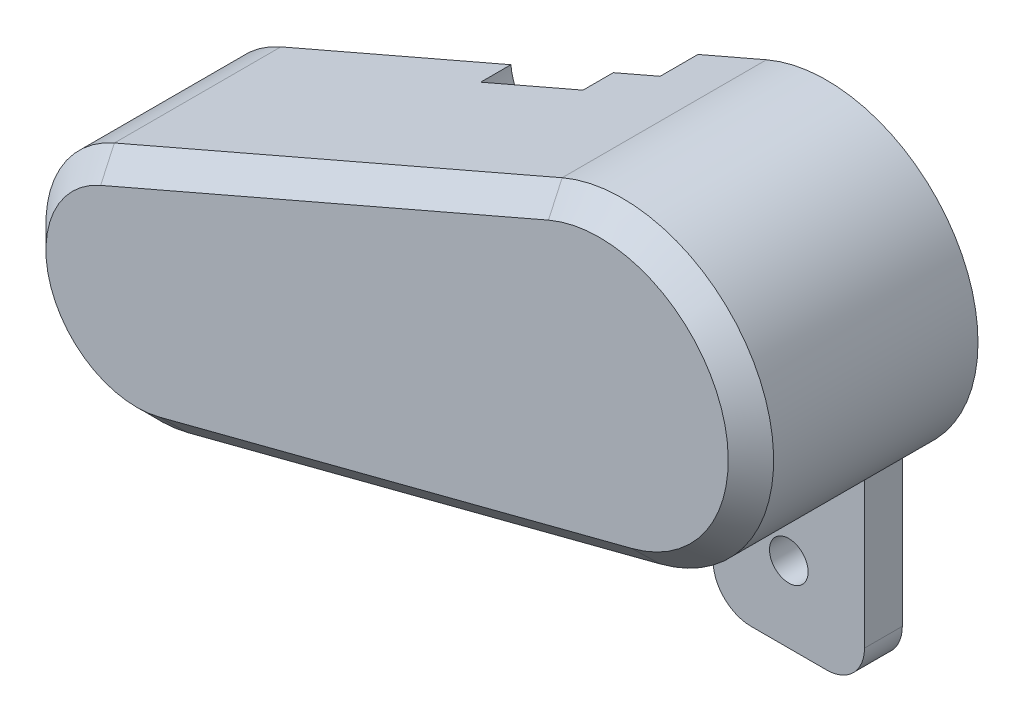
ISO-10303-21;
HEADER;
FILE_DESCRIPTION(('STEP AP214'),'2;1');
FILE_NAME('part.step','',(''),(''),'','','');
FILE_SCHEMA(('AUTOMOTIVE_DESIGN { 1 0 10303 214 1 1 1 1 }'));
ENDSEC;
DATA;
#1=APPLICATION_CONTEXT('core data for automotive mechanical design processes');
#2=APPLICATION_PROTOCOL_DEFINITION('international standard','automotive_design',2000,#1);
#3=PRODUCT_CONTEXT('',#1,'mechanical');
#4=PRODUCT('Part','Part','',(#3));
#5=PRODUCT_RELATED_PRODUCT_CATEGORY('part','',(#4));
#6=PRODUCT_DEFINITION_FORMATION('','',#4);
#7=PRODUCT_DEFINITION_CONTEXT('part definition',#1,'design');
#8=PRODUCT_DEFINITION('design','',#6,#7);
#9=PRODUCT_DEFINITION_SHAPE('','',#8);
#10=(LENGTH_UNIT() NAMED_UNIT(*) SI_UNIT(.MILLI.,.METRE.));
#11=(NAMED_UNIT(*) PLANE_ANGLE_UNIT() SI_UNIT($,.RADIAN.));
#12=(NAMED_UNIT(*) SI_UNIT($,.STERADIAN.) SOLID_ANGLE_UNIT());
#13=UNCERTAINTY_MEASURE_WITH_UNIT(LENGTH_MEASURE(1.E-05),#10,'distance_accuracy_value','');
#14=(GEOMETRIC_REPRESENTATION_CONTEXT(3) GLOBAL_UNCERTAINTY_ASSIGNED_CONTEXT((#13)) GLOBAL_UNIT_ASSIGNED_CONTEXT((#10,
#11,#12)) REPRESENTATION_CONTEXT('',''));
#15=CARTESIAN_POINT('',(0.,0.,0.));
#16=DIRECTION('',(0.,0.,1.));
#17=DIRECTION('',(1.,0.,0.));
#18=AXIS2_PLACEMENT_3D('',#15,#16,#17);
#19=CARTESIAN_POINT('',(-48.1077623284354,-39.7505775901013,29.9999935625005));
#20=DIRECTION('',(0.39718415521736,-0.91773893174708,0.));
#21=DIRECTION('',(0.91773893174708,0.39718415521736,0.));
#22=AXIS2_PLACEMENT_3D('',#19,#20,#21);
#23=PLANE('',#22);
#24=DIRECTION('',(0.,0.,-1.));
#25=VECTOR('',#24,1.);
#26=CARTESIAN_POINT('',(-17.7154879863189,-26.5972401951977,8.99999356250022));
#27=LINE('',#26,#25);
#28=CARTESIAN_POINT('',(-17.7154879863189,-26.5972401951977,4.99999356250022));
#29=VERTEX_POINT('',#28);
#30=CARTESIAN_POINT('',(-17.7154879863189,-26.5972401951977,8.99999356250022));
#31=VERTEX_POINT('',#30);
#32=EDGE_CURVE('E277',#29,#31,#27,.F.);
#33=ORIENTED_EDGE('',*,*,#32,.F.);
#34=DIRECTION('',(0.91773893174708,0.39718415521736,0.));
#35=VECTOR('',#34,1.);
#36=CARTESIAN_POINT('',(-48.1077623284354,-39.7505775901013,4.99999356250022));
#37=LINE('',#36,#35);
#38=CARTESIAN_POINT('',(-48.1077623284354,-39.7505775901013,4.99999356250022));
#39=VERTEX_POINT('',#38);
#40=EDGE_CURVE('E306',#39,#29,#37,.T.);
#41=ORIENTED_EDGE('',*,*,#40,.F.);
#42=DIRECTION('',(0.,0.,-1.));
#43=VECTOR('',#42,1.);
#44=CARTESIAN_POINT('',(-48.1077623284354,-39.7505775901013,29.9999935625005));
#45=LINE('',#44,#43);
#46=CARTESIAN_POINT('',(-48.1077623284354,-39.7505775901013,26.9999935625005));
#47=VERTEX_POINT('',#46);
#48=EDGE_CURVE('E337',#47,#39,#45,.T.);
#49=ORIENTED_EDGE('',*,*,#48,.F.);
#50=DIRECTION('',(0.91773893174708,0.39718415521736,0.));
#51=VECTOR('',#50,1.);
#52=CARTESIAN_POINT('',(11.0563104581527,-14.1452213650747,26.9999935625005));
#53=LINE('',#52,#51);
#54=CARTESIAN_POINT('',(11.0563104581527,-14.1452213650747,26.9999935625005));
#55=VERTEX_POINT('',#54);
#56=EDGE_CURVE('E386',#47,#55,#53,.T.);
#57=ORIENTED_EDGE('',*,*,#56,.T.);
#58=DIRECTION('',(0.,0.,-1.));
#59=VECTOR('',#58,1.);
#60=CARTESIAN_POINT('',(11.0563104581527,-14.1452213650747,29.9999935625005));
#61=LINE('',#60,#59);
#62=CARTESIAN_POINT('',(11.0563104581527,-14.1452213650747,0.));
#63=VERTEX_POINT('',#62);
#64=EDGE_CURVE('E341',#55,#63,#61,.T.);
#65=ORIENTED_EDGE('',*,*,#64,.T.);
#66=DIRECTION('',(-0.91773893174708,-0.39718415521736,0.));
#67=VECTOR('',#66,1.);
#68=CARTESIAN_POINT('',(-48.1077623284354,-39.7505775901013,0.));
#69=LINE('',#68,#67);
#70=CARTESIAN_POINT('',(2.,-18.0646617356166,0.));
#71=VERTEX_POINT('',#70);
#72=EDGE_CURVE('E327',#63,#71,#69,.T.);
#73=ORIENTED_EDGE('',*,*,#72,.T.);
#74=DIRECTION('',(0.,0.,-1.));
#75=VECTOR('',#74,1.);
#76=CARTESIAN_POINT('',(2.,-18.0646617356166,29.9999935625005));
#77=LINE('',#76,#75);
#78=CARTESIAN_POINT('',(2.,-18.0646617356166,4.99999356250022));
#79=VERTEX_POINT('',#78);
#80=EDGE_CURVE('E291',#79,#71,#77,.T.);
#81=ORIENTED_EDGE('',*,*,#80,.F.);
#82=CARTESIAN_POINT('',(-4.18622111210832,-20.7419688884504,4.99999356250022));
#83=VERTEX_POINT('',#82);
#84=EDGE_CURVE('E305',#83,#79,#37,.T.);
#85=ORIENTED_EDGE('',*,*,#84,.F.);
#86=DIRECTION('',(0.,0.,-1.));
#87=VECTOR('',#86,1.);
#88=CARTESIAN_POINT('',(-4.18622111210832,-20.7419688884504,8.99999356250022));
#89=LINE('',#88,#87);
#90=CARTESIAN_POINT('',(-4.18622111210832,-20.7419688884504,8.99999356250022));
#91=VERTEX_POINT('',#90);
#92=EDGE_CURVE('E275',#91,#83,#89,.T.);
#93=ORIENTED_EDGE('',*,*,#92,.F.);
#94=DIRECTION('',(-0.91773893174708,-0.39718415521736,0.));
#95=VECTOR('',#94,1.);
#96=CARTESIAN_POINT('',(-48.1077623284354,-39.7505775901013,8.99999356250022));
#97=LINE('',#96,#95);
#98=EDGE_CURVE('E279',#91,#31,#97,.T.);
#99=ORIENTED_EDGE('',*,*,#98,.T.);
#100=EDGE_LOOP('',(#33,#41,#49,#57,#65,#73,#81,#85,#93,#99));
#101=FACE_BOUND('',#100,.T.);
#102=ADVANCED_FACE('F32',(#101),#23,.F.);
#103=CARTESIAN_POINT('',(-46.9162098627834,-42.5037943853426,-111.277525292104));
#104=DIRECTION('',(0.39718415521736,-0.91773893174708,0.));
#105=DIRECTION('',(0.91773893174708,0.39718415521736,0.));
#106=AXIS2_PLACEMENT_3D('',#103,#104,#105);
#107=PLANE('',#106);
#108=DIRECTION('',(0.91773893174708,0.39718415521736,0.));
#109=VECTOR('',#108,1.);
#110=CARTESIAN_POINT('',(-46.9162098627834,-42.5037943853426,4.99999356250022));
#111=LINE('',#110,#109);
#112=CARTESIAN_POINT('',(-46.9162098627834,-42.5037943853426,4.99999356250022));
#113=VERTEX_POINT('',#112);
#114=CARTESIAN_POINT('',(-16.8500010206727,-29.4915734296411,4.99999356250022));
#115=VERTEX_POINT('',#114);
#116=EDGE_CURVE('E302',#113,#115,#111,.T.);
#117=ORIENTED_EDGE('',*,*,#116,.T.);
#118=DIRECTION('',(0.,0.,-1.));
#119=VECTOR('',#118,1.);
#120=CARTESIAN_POINT('',(-16.8500010206727,-29.4915734296411,8.99999356250022));
#121=LINE('',#120,#119);
#122=CARTESIAN_POINT('',(-16.8500010206727,-29.4915734296411,8.99999356250022));
#123=VERTEX_POINT('',#122);
#124=EDGE_CURVE('E272',#115,#123,#121,.F.);
#125=ORIENTED_EDGE('',*,*,#124,.T.);
#126=DIRECTION('',(-0.91773893174708,-0.39718415521736,0.));
#127=VECTOR('',#126,1.);
#128=CARTESIAN_POINT('',(-46.9162098627834,-42.5037943853426,8.99999356250022));
#129=LINE('',#128,#127);
#130=CARTESIAN_POINT('',(-2.66860314645035,-23.3540692444895,8.99999356250022));
#131=VERTEX_POINT('',#130);
#132=EDGE_CURVE('E11',#131,#123,#129,.T.);
#133=ORIENTED_EDGE('',*,*,#132,.F.);
#134=DIRECTION('',(0.,0.,-1.));
#135=VECTOR('',#134,1.);
#136=CARTESIAN_POINT('',(-2.66860314645035,-23.3540692444895,8.99999356250022));
#137=LINE('',#136,#135);
#138=CARTESIAN_POINT('',(-2.66860314645035,-23.3540692444895,4.99999356250022));
#139=VERTEX_POINT('',#138);
#140=EDGE_CURVE('E266',#131,#139,#137,.T.);
#141=ORIENTED_EDGE('',*,*,#140,.T.);
#142=CARTESIAN_POINT('',(2.,-21.3335652289978,4.99999356250022));
#143=VERTEX_POINT('',#142);
#144=EDGE_CURVE('E301',#139,#143,#111,.T.);
#145=ORIENTED_EDGE('',*,*,#144,.T.);
#146=DIRECTION('',(0.,0.,-1.));
#147=VECTOR('',#146,1.);
#148=CARTESIAN_POINT('',(2.,-21.3335652289978,-111.277525292104));
#149=LINE('',#148,#147);
#150=CARTESIAN_POINT('',(2.,-21.3335652289978,0.));
#151=VERTEX_POINT('',#150);
#152=EDGE_CURVE('E288',#143,#151,#149,.T.);
#153=ORIENTED_EDGE('',*,*,#152,.T.);
#154=DIRECTION('',(-0.91773893174708,-0.39718415521736,0.));
#155=VECTOR('',#154,1.);
#156=CARTESIAN_POINT('',(-46.9162098627834,-42.5037943853426,0.));
#157=LINE('',#156,#155);
#158=CARTESIAN_POINT('',(12.2478629238048,-16.8984381603159,0.));
#159=VERTEX_POINT('',#158);
#160=EDGE_CURVE('E334',#159,#151,#157,.T.);
#161=ORIENTED_EDGE('',*,*,#160,.F.);
#162=DIRECTION('',(0.,0.,1.));
#163=VECTOR('',#162,1.);
#164=CARTESIAN_POINT('',(12.2478629238048,-16.8984381603159,-111.277525292104));
#165=LINE('',#164,#163);
#166=CARTESIAN_POINT('',(12.2478629238048,-16.8984381603159,23.9999935625005));
#167=VERTEX_POINT('',#166);
#168=EDGE_CURVE('E320',#159,#167,#165,.T.);
#169=ORIENTED_EDGE('',*,*,#168,.T.);
#170=DIRECTION('',(-0.91773893174708,-0.39718415521736,0.));
#171=VECTOR('',#170,1.);
#172=CARTESIAN_POINT('',(-46.9162098627834,-42.5037943853426,23.9999935625005));
#173=LINE('',#172,#171);
#174=CARTESIAN_POINT('',(-46.9162098627834,-42.5037943853426,23.9999935625005));
#175=VERTEX_POINT('',#174);
#176=EDGE_CURVE('E367',#167,#175,#173,.T.);
#177=ORIENTED_EDGE('',*,*,#176,.T.);
#178=DIRECTION('',(0.,0.,1.));
#179=VECTOR('',#178,1.);
#180=CARTESIAN_POINT('',(-46.9162098627834,-42.5037943853426,-111.277525292104));
#181=LINE('',#180,#179);
#182=EDGE_CURVE('E318',#113,#175,#181,.T.);
#183=ORIENTED_EDGE('',*,*,#182,.F.);
#184=EDGE_LOOP('',(#117,#125,#133,#141,#145,#153,#161,#169,#177,#183));
#185=FACE_BOUND('',#184,.T.);
#186=ADVANCED_FACE('F420',(#185),#107,.T.);
#187=CARTESIAN_POINT('',(0.,0.,4.99999356250022));
#188=DIRECTION('',(0.,0.,-1.));
#189=DIRECTION('',(-1.,0.,0.));
#190=AXIS2_PLACEMENT_3D('',#187,#188,#189);
#191=PLANE('',#190);
#192=ORIENTED_EDGE('',*,*,#40,.T.);
#193=CARTESIAN_POINT('',(-9.99999999999934,-25.86666156633,4.99999356250022));
#194=DIRECTION('',(0.,0.,-1.));
#195=DIRECTION('',(-1.,0.,0.));
#196=AXIS2_PLACEMENT_3D('',#193,#194,#195);
#197=CIRCLE('',#196,7.75);
#198=EDGE_CURVE('E40',#29,#115,#197,.F.);
#199=ORIENTED_EDGE('',*,*,#198,.T.);
#200=ORIENTED_EDGE('',*,*,#116,.F.);
#201=CARTESIAN_POINT('',(-42.150000000175,-53.5166615663075,4.99999356250022));
#202=DIRECTION('',(0.,0.,-1.));
#203=DIRECTION('',(-1.,0.,0.));
#204=AXIS2_PLACEMENT_3D('',#201,#202,#203);
#205=CIRCLE('',#204,12.);
#206=CARTESIAN_POINT('',(-39.1388633279181,-65.1327304340867,4.99999356250022));
#207=VERTEX_POINT('',#206);
#208=EDGE_CURVE('E298',#207,#113,#205,.T.);
#209=ORIENTED_EDGE('',*,*,#208,.F.);
#210=DIRECTION('',(-0.968005738981601,-0.250928056021413,0.));
#211=VECTOR('',#210,1.);
#212=CARTESIAN_POINT('',(23.2657705148639,-48.9560975627035,4.99999356250022));
#213=LINE('',#212,#211);
#214=CARTESIAN_POINT('',(-17.9999999999994,-59.6530791595422,4.99999356250022));
#215=VERTEX_POINT('',#214);
#216=EDGE_CURVE('E410',#215,#207,#213,.T.);
#217=ORIENTED_EDGE('',*,*,#216,.F.);
#218=DIRECTION('',(0.,-1.,0.));
#219=VECTOR('',#218,1.);
#220=CARTESIAN_POINT('',(-17.9999999999994,-39.36666156633,4.99999356250022));
#221=LINE('',#220,#219);
#222=CARTESIAN_POINT('',(-17.9999999999994,-62.7522343392999,4.99999356250022));
#223=VERTEX_POINT('',#222);
#224=EDGE_CURVE('E285',#215,#223,#221,.T.);
#225=ORIENTED_EDGE('',*,*,#224,.T.);
#226=DIRECTION('',(-0.968005738981601,-0.250928056021413,0.));
#227=VECTOR('',#226,1.);
#228=CARTESIAN_POINT('',(-38.3860791598538,-68.0367476510315,4.99999356250022));
#229=LINE('',#228,#227);
#230=CARTESIAN_POINT('',(-38.3860791598538,-68.0367476510315,4.99999356250022));
#231=VERTEX_POINT('',#230);
#232=EDGE_CURVE('E311',#223,#231,#229,.T.);
#233=ORIENTED_EDGE('',*,*,#232,.T.);
#234=CARTESIAN_POINT('',(-42.150000000175,-53.5166615663075,4.99999356250022));
#235=DIRECTION('',(0.,0.,-1.));
#236=DIRECTION('',(-1.,0.,0.));
#237=AXIS2_PLACEMENT_3D('',#234,#235,#236);
#238=CIRCLE('',#237,15.);
#239=EDGE_CURVE('E309',#231,#39,#238,.T.);
#240=ORIENTED_EDGE('',*,*,#239,.T.);
#241=EDGE_LOOP('',(#192,#199,#200,#209,#217,#225,#233,#240));
#242=FACE_BOUND('',#241,.T.);
#243=ADVANCED_FACE('F414',(#242),#191,.T.);
#244=ORIENTED_EDGE('',*,*,#144,.F.);
#245=CARTESIAN_POINT('',(-9.99999999999934,-25.86666156633,4.99999356250022));
#246=DIRECTION('',(0.,0.,1.));
#247=DIRECTION('',(1.,0.,0.));
#248=AXIS2_PLACEMENT_3D('',#245,#246,#247);
#249=CIRCLE('',#248,7.75);
#250=EDGE_CURVE('E256',#139,#83,#249,.T.);
#251=ORIENTED_EDGE('',*,*,#250,.T.);
#252=ORIENTED_EDGE('',*,*,#84,.T.);
#253=DIRECTION('',(0.,-1.,0.));
#254=VECTOR('',#253,1.);
#255=CARTESIAN_POINT('',(2.,-10.5000000000155,4.99999356250022));
#256=LINE('',#255,#254);
#257=EDGE_CURVE('E282',#79,#143,#256,.T.);
#258=ORIENTED_EDGE('',*,*,#257,.T.);
#259=EDGE_LOOP('',(#244,#251,#252,#258));
#260=FACE_BOUND('',#259,.T.);
#261=ADVANCED_FACE('F489',(#260),#191,.T.);
#262=CARTESIAN_POINT('',(-42.150000000175,-53.5166615663075,29.9999935625005));
#263=DIRECTION('',(0.,0.,-1.));
#264=DIRECTION('',(-1.,0.,0.));
#265=AXIS2_PLACEMENT_3D('',#262,#263,#264);
#266=CYLINDRICAL_SURFACE('',#265,15.);
#267=ORIENTED_EDGE('',*,*,#239,.F.);
#268=DIRECTION('',(0.,0.,-1.));
#269=VECTOR('',#268,1.);
#270=CARTESIAN_POINT('',(-38.3860791598538,-68.0367476510315,29.9999935625005));
#271=LINE('',#270,#269);
#272=CARTESIAN_POINT('',(-38.3860791598538,-68.0367476510315,26.9999935625005));
#273=VERTEX_POINT('',#272);
#274=EDGE_CURVE('E347',#273,#231,#271,.T.);
#275=ORIENTED_EDGE('',*,*,#274,.F.);
#276=CARTESIAN_POINT('',(-42.150000000175,-53.5166615663075,26.9999935625005));
#277=DIRECTION('',(0.,0.,1.));
#278=DIRECTION('',(1.,0.,0.));
#279=AXIS2_PLACEMENT_3D('',#276,#277,#278);
#280=CIRCLE('',#279,15.);
#281=EDGE_CURVE('E384',#273,#47,#280,.F.);
#282=ORIENTED_EDGE('',*,*,#281,.T.);
#283=ORIENTED_EDGE('',*,*,#48,.T.);
#284=EDGE_LOOP('',(#267,#275,#282,#283));
#285=FACE_BOUND('',#284,.T.);
#286=ADVANCED_FACE('F486',(#285),#266,.T.);
#287=CARTESIAN_POINT('',(-38.3860791598538,-68.0367476510315,29.9999935625005));
#288=DIRECTION('',(-0.250928056021413,0.9680057389816,0.));
#289=DIRECTION('',(-0.968005738981601,-0.250928056021413,0.));
#290=AXIS2_PLACEMENT_3D('',#287,#288,#289);
#291=PLANE('',#290);
#292=DIRECTION('',(0.968005738981601,0.250928056021413,0.));
#293=VECTOR('',#292,1.);
#294=CARTESIAN_POINT('',(24.0185546829281,-51.8601147796483,0.));
#295=LINE('',#294,#293);
#296=CARTESIAN_POINT('',(-17.9999999999994,-62.7522343392999,0.));
#297=VERTEX_POINT('',#296);
#298=CARTESIAN_POINT('',(8.99999356249987,-55.7532511469519,0.));
#299=VERTEX_POINT('',#298);
#300=EDGE_CURVE('E52',#297,#299,#295,.T.);
#301=ORIENTED_EDGE('',*,*,#300,.T.);
#302=DIRECTION('',(0.,0.,-1.));
#303=VECTOR('',#302,1.);
#304=CARTESIAN_POINT('',(8.99999356249987,-55.7532511469519,5.));
#305=LINE('',#304,#303);
#306=CARTESIAN_POINT('',(8.99999356249987,-55.7532511469519,5.));
#307=VERTEX_POINT('',#306);
#308=EDGE_CURVE('E47',#307,#299,#305,.T.);
#309=ORIENTED_EDGE('',*,*,#308,.F.);
#310=DIRECTION('',(0.9680057389816,0.250928056021413,0.));
#311=VECTOR('',#310,1.);
#312=CARTESIAN_POINT('',(8.99999356249987,-55.7532511469519,5.));
#313=LINE('',#312,#311);
#314=CARTESIAN_POINT('',(24.0185546829281,-51.8601147796483,5.));
#315=VERTEX_POINT('',#314);
#316=EDGE_CURVE('E231',#307,#315,#313,.T.);
#317=ORIENTED_EDGE('',*,*,#316,.T.);
#318=DIRECTION('',(0.,0.,-1.));
#319=VECTOR('',#318,1.);
#320=CARTESIAN_POINT('',(24.0185546829281,-51.8601147796483,29.9999935625005));
#321=LINE('',#320,#319);
#322=CARTESIAN_POINT('',(24.0185546829281,-51.8601147796483,26.9999935625005));
#323=VERTEX_POINT('',#322);
#324=EDGE_CURVE('E344',#323,#315,#321,.T.);
#325=ORIENTED_EDGE('',*,*,#324,.F.);
#326=DIRECTION('',(-0.968005738981601,-0.250928056021413,0.));
#327=VECTOR('',#326,1.);
#328=CARTESIAN_POINT('',(-38.3860791598538,-68.0367476510315,26.9999935625005));
#329=LINE('',#328,#327);
#330=EDGE_CURVE('E379',#323,#273,#329,.T.);
#331=ORIENTED_EDGE('',*,*,#330,.T.);
#332=ORIENTED_EDGE('',*,*,#274,.T.);
#333=ORIENTED_EDGE('',*,*,#232,.F.);
#334=DIRECTION('',(0.,0.,1.));
#335=VECTOR('',#334,1.);
#336=CARTESIAN_POINT('',(-17.9999999999994,-62.7522343392999,29.9999935625005));
#337=LINE('',#336,#335);
#338=EDGE_CURVE('E296',#297,#223,#337,.T.);
#339=ORIENTED_EDGE('',*,*,#338,.F.);
#340=EDGE_LOOP('',(#301,#309,#317,#325,#331,#332,#333,#339));
#341=FACE_BOUND('',#340,.T.);
#342=ADVANCED_FACE('F483',(#341),#291,.F.);
#343=CARTESIAN_POINT('',(-42.150000000175,-53.5166615663075,-111.277525292104));
#344=DIRECTION('',(0.,0.,1.));
#345=DIRECTION('',(1.,0.,0.));
#346=AXIS2_PLACEMENT_3D('',#343,#344,#345);
#347=CYLINDRICAL_SURFACE('',#346,12.);
#348=DIRECTION('',(0.,0.,1.));
#349=VECTOR('',#348,1.);
#350=CARTESIAN_POINT('',(-39.1388633279181,-65.1327304340867,-111.277525292104));
#351=LINE('',#350,#349);
#352=CARTESIAN_POINT('',(-39.1388633279181,-65.1327304340867,23.9999935625005));
#353=VERTEX_POINT('',#352);
#354=EDGE_CURVE('E317',#207,#353,#351,.T.);
#355=ORIENTED_EDGE('',*,*,#354,.F.);
#356=ORIENTED_EDGE('',*,*,#208,.T.);
#357=ORIENTED_EDGE('',*,*,#182,.T.);
#358=CARTESIAN_POINT('',(-42.150000000175,-53.5166615663075,23.9999935625005));
#359=DIRECTION('',(0.,0.,1.));
#360=DIRECTION('',(1.,0.,0.));
#361=AXIS2_PLACEMENT_3D('',#358,#359,#360);
#362=CIRCLE('',#361,12.);
#363=EDGE_CURVE('E362',#175,#353,#362,.T.);
#364=ORIENTED_EDGE('',*,*,#363,.T.);
#365=EDGE_LOOP('',(#355,#356,#357,#364));
#366=FACE_BOUND('',#365,.T.);
#367=ADVANCED_FACE('F426',(#366),#347,.F.);
#368=CARTESIAN_POINT('',(23.2657705148639,-48.9560975627035,-111.277525292104));
#369=DIRECTION('',(-0.250928056021413,0.968005738981601,0.));
#370=DIRECTION('',(-0.968005738981601,-0.250928056021413,0.));
#371=AXIS2_PLACEMENT_3D('',#368,#369,#370);
#372=PLANE('',#371);
#373=DIRECTION('',(0.,0.,1.));
#374=VECTOR('',#373,1.);
#375=CARTESIAN_POINT('',(-17.9999999999994,-59.6530791595422,-111.277525292104));
#376=LINE('',#375,#374);
#377=CARTESIAN_POINT('',(-17.9999999999994,-59.6530791595422,0.));
#378=VERTEX_POINT('',#377);
#379=EDGE_CURVE('E293',#378,#215,#376,.T.);
#380=ORIENTED_EDGE('',*,*,#379,.T.);
#381=ORIENTED_EDGE('',*,*,#216,.T.);
#382=ORIENTED_EDGE('',*,*,#354,.T.);
#383=DIRECTION('',(0.968005738981601,0.250928056021413,0.));
#384=VECTOR('',#383,1.);
#385=CARTESIAN_POINT('',(23.2657705148639,-48.9560975627035,23.9999935625005));
#386=LINE('',#385,#384);
#387=CARTESIAN_POINT('',(23.2657705148639,-48.9560975627035,23.9999935625005));
#388=VERTEX_POINT('',#387);
#389=EDGE_CURVE('E359',#353,#388,#386,.T.);
#390=ORIENTED_EDGE('',*,*,#389,.T.);
#391=DIRECTION('',(0.,0.,1.));
#392=VECTOR('',#391,1.);
#393=CARTESIAN_POINT('',(23.2657705148639,-48.9560975627035,-111.277525292104));
#394=LINE('',#393,#392);
#395=CARTESIAN_POINT('',(23.2657705148639,-48.9560975627035,0.));
#396=VERTEX_POINT('',#395);
#397=EDGE_CURVE('E323',#396,#388,#394,.T.);
#398=ORIENTED_EDGE('',*,*,#397,.F.);
#399=DIRECTION('',(0.968005738981601,0.250928056021413,0.));
#400=VECTOR('',#399,1.);
#401=CARTESIAN_POINT('',(23.2657705148639,-48.9560975627035,0.));
#402=LINE('',#401,#400);
#403=EDGE_CURVE('E314',#378,#396,#402,.T.);
#404=ORIENTED_EDGE('',*,*,#403,.F.);
#405=EDGE_LOOP('',(#380,#381,#382,#390,#398,#404));
#406=FACE_BOUND('',#405,.T.);
#407=ADVANCED_FACE('F431',(#406),#372,.T.);
#408=CARTESIAN_POINT('',(0.,0.,0.));
#409=DIRECTION('',(0.,0.,1.));
#410=DIRECTION('',(1.,0.,0.));
#411=AXIS2_PLACEMENT_3D('',#408,#409,#410);
#412=PLANE('',#411);
#413=DIRECTION('',(0.,-1.,0.));
#414=VECTOR('',#413,1.);
#415=CARTESIAN_POINT('',(-17.9999999999994,0.,0.));
#416=LINE('',#415,#414);
#417=EDGE_CURVE('E408',#378,#297,#416,.T.);
#418=ORIENTED_EDGE('',*,*,#417,.F.);
#419=ORIENTED_EDGE('',*,*,#403,.T.);
#420=CARTESIAN_POINT('',(18.9999935624999,-32.5000000000163,0.));
#421=DIRECTION('',(0.,0.,1.));
#422=DIRECTION('',(1.,0.,0.));
#423=AXIS2_PLACEMENT_3D('',#420,#421,#422);
#424=CIRCLE('',#423,17.);
#425=EDGE_CURVE('E316',#396,#159,#424,.T.);
#426=ORIENTED_EDGE('',*,*,#425,.T.);
#427=ORIENTED_EDGE('',*,*,#160,.T.);
#428=DIRECTION('',(0.,-1.,0.));
#429=VECTOR('',#428,1.);
#430=CARTESIAN_POINT('',(2.,0.,0.));
#431=LINE('',#430,#429);
#432=EDGE_CURVE('E388',#71,#151,#431,.T.);
#433=ORIENTED_EDGE('',*,*,#432,.F.);
#434=ORIENTED_EDGE('',*,*,#72,.F.);
#435=CARTESIAN_POINT('',(18.9999935624999,-32.5000000000163,0.));
#436=DIRECTION('',(0.,0.,1.));
#437=DIRECTION('',(1.,0.,0.));
#438=AXIS2_PLACEMENT_3D('',#435,#436,#437);
#439=CIRCLE('',#438,20.);
#440=CARTESIAN_POINT('',(28.9999935624999,-49.8205080757051,0.));
#441=VERTEX_POINT('',#440);
#442=EDGE_CURVE('E330',#441,#63,#439,.T.);
#443=ORIENTED_EDGE('',*,*,#442,.F.);
#444=DIRECTION('',(0.,-1.,0.));
#445=VECTOR('',#444,1.);
#446=CARTESIAN_POINT('',(28.9999935624999,-70.0000000000163,0.));
#447=LINE('',#446,#445);
#448=CARTESIAN_POINT('',(28.9999935624999,-70.0000000000163,0.));
#449=VERTEX_POINT('',#448);
#450=EDGE_CURVE('E242',#441,#449,#447,.T.);
#451=ORIENTED_EDGE('',*,*,#450,.T.);
#452=CARTESIAN_POINT('',(23.9999935624999,-70.0000000000163,0.));
#453=DIRECTION('',(0.,0.,-1.));
#454=DIRECTION('',(-1.,0.,0.));
#455=AXIS2_PLACEMENT_3D('',#452,#453,#454);
#456=CIRCLE('',#455,5.);
#457=CARTESIAN_POINT('',(23.9999935624999,-75.0000000000163,0.));
#458=VERTEX_POINT('',#457);
#459=EDGE_CURVE('E208',#449,#458,#456,.T.);
#460=ORIENTED_EDGE('',*,*,#459,.T.);
#461=DIRECTION('',(-1.,0.,0.));
#462=VECTOR('',#461,1.);
#463=CARTESIAN_POINT('',(13.9999935624999,-75.0000000000163,0.));
#464=LINE('',#463,#462);
#465=CARTESIAN_POINT('',(13.9999935624999,-75.0000000000163,0.));
#466=VERTEX_POINT('',#465);
#467=EDGE_CURVE('E246',#458,#466,#464,.T.);
#468=ORIENTED_EDGE('',*,*,#467,.T.);
#469=CARTESIAN_POINT('',(13.9999935624999,-70.0000000000163,0.));
#470=DIRECTION('',(0.,0.,-1.));
#471=DIRECTION('',(-1.,0.,0.));
#472=AXIS2_PLACEMENT_3D('',#469,#470,#471);
#473=CIRCLE('',#472,5.);
#474=CARTESIAN_POINT('',(8.99999356249987,-70.0000000000163,0.));
#475=VERTEX_POINT('',#474);
#476=EDGE_CURVE('E249',#466,#475,#473,.T.);
#477=ORIENTED_EDGE('',*,*,#476,.T.);
#478=DIRECTION('',(0.,1.,0.));
#479=VECTOR('',#478,1.);
#480=CARTESIAN_POINT('',(8.99999356249987,-55.7532511469519,0.));
#481=LINE('',#480,#479);
#482=EDGE_CURVE('E252',#475,#299,#481,.T.);
#483=ORIENTED_EDGE('',*,*,#482,.T.);
#484=ORIENTED_EDGE('',*,*,#300,.F.);
#485=EDGE_LOOP('',(#418,#419,#426,#427,#433,#434,#443,#451,#460,#468,#477,#483,#484));
#486=FACE_BOUND('',#485,.T.);
#487=CARTESIAN_POINT('',(18.9999935624999,-65.0000000000163,0.));
#488=DIRECTION('',(0.,0.,-1.));
#489=DIRECTION('',(-1.,0.,0.));
#490=AXIS2_PLACEMENT_3D('',#487,#488,#489);
#491=CIRCLE('',#490,2.55);
#492=CARTESIAN_POINT('',(16.4499935624999,-65.0000000000163,0.));
#493=VERTEX_POINT('',#492);
#494=EDGE_CURVE('E448',#493,#493,#491,.T.);
#495=ORIENTED_EDGE('',*,*,#494,.F.);
#496=EDGE_LOOP('',(#495));
#497=FACE_BOUND('',#496,.T.);
#498=ADVANCED_FACE('F438',(#486,#497),#412,.F.);
#499=CARTESIAN_POINT('',(18.9999935624999,-32.5000000000163,29.9999935625005));
#500=DIRECTION('',(0.,0.,-1.));
#501=DIRECTION('',(-1.,0.,0.));
#502=AXIS2_PLACEMENT_3D('',#499,#500,#501);
#503=CYLINDRICAL_SURFACE('',#502,20.);
#504=CARTESIAN_POINT('',(18.9999935624999,-32.5000000000163,5.));
#505=DIRECTION('',(0.,0.,1.));
#506=DIRECTION('',(-1.,0.,0.));
#507=AXIS2_PLACEMENT_3D('',#504,#505,#506);
#508=CIRCLE('',#507,20.);
#509=CARTESIAN_POINT('',(28.9999935624999,-49.8205080757051,5.));
#510=VERTEX_POINT('',#509);
#511=EDGE_CURVE('E229',#315,#510,#508,.T.);
#512=ORIENTED_EDGE('',*,*,#511,.T.);
#513=DIRECTION('',(0.,0.,-1.));
#514=VECTOR('',#513,1.);
#515=CARTESIAN_POINT('',(28.9999935624999,-49.8205080757051,5.));
#516=LINE('',#515,#514);
#517=EDGE_CURVE('E214',#510,#441,#516,.T.);
#518=ORIENTED_EDGE('',*,*,#517,.T.);
#519=ORIENTED_EDGE('',*,*,#442,.T.);
#520=ORIENTED_EDGE('',*,*,#64,.F.);
#521=CARTESIAN_POINT('',(18.9999935624999,-32.5000000000163,26.9999935625005));
#522=DIRECTION('',(0.,0.,1.));
#523=DIRECTION('',(1.,0.,0.));
#524=AXIS2_PLACEMENT_3D('',#521,#522,#523);
#525=CIRCLE('',#524,20.);
#526=EDGE_CURVE('E382',#55,#323,#525,.F.);
#527=ORIENTED_EDGE('',*,*,#526,.T.);
#528=ORIENTED_EDGE('',*,*,#324,.T.);
#529=EDGE_LOOP('',(#512,#518,#519,#520,#527,#528));
#530=FACE_BOUND('',#529,.T.);
#531=ADVANCED_FACE('F461',(#530),#503,.T.);
#532=CARTESIAN_POINT('',(-42.150000000175,-53.5166615663075,29.9999935625005));
#533=DIRECTION('',(0.,0.,1.));
#534=DIRECTION('',(1.,0.,0.));
#535=AXIS2_PLACEMENT_3D('',#532,#533,#534);
#536=PLANE('',#535);
#537=CARTESIAN_POINT('',(-42.150000000175,-53.5166615663075,29.9999935625005));
#538=DIRECTION('',(0.,0.,1.));
#539=DIRECTION('',(1.,0.,0.));
#540=AXIS2_PLACEMENT_3D('',#537,#538,#539);
#541=CIRCLE('',#540,12.);
#542=CARTESIAN_POINT('',(-46.9162098627834,-42.5037943853426,29.9999935625005));
#543=VERTEX_POINT('',#542);
#544=CARTESIAN_POINT('',(-39.1388633279181,-65.1327304340867,29.9999935625005));
#545=VERTEX_POINT('',#544);
#546=EDGE_CURVE('E372',#543,#545,#541,.T.);
#547=ORIENTED_EDGE('',*,*,#546,.T.);
#548=DIRECTION('',(0.968005738981601,0.250928056021413,0.));
#549=VECTOR('',#548,1.);
#550=CARTESIAN_POINT('',(23.2657705148639,-48.9560975627035,29.9999935625005));
#551=LINE('',#550,#549);
#552=CARTESIAN_POINT('',(23.2657705148639,-48.9560975627035,29.9999935625005));
#553=VERTEX_POINT('',#552);
#554=EDGE_CURVE('E376',#545,#553,#551,.T.);
#555=ORIENTED_EDGE('',*,*,#554,.T.);
#556=CARTESIAN_POINT('',(18.9999935624999,-32.5000000000163,29.9999935625005));
#557=DIRECTION('',(0.,0.,1.));
#558=DIRECTION('',(1.,0.,0.));
#559=AXIS2_PLACEMENT_3D('',#556,#557,#558);
#560=CIRCLE('',#559,17.);
#561=CARTESIAN_POINT('',(12.2478629238048,-16.8984381603159,29.9999935625005));
#562=VERTEX_POINT('',#561);
#563=EDGE_CURVE('E374',#553,#562,#560,.T.);
#564=ORIENTED_EDGE('',*,*,#563,.T.);
#565=DIRECTION('',(-0.91773893174708,-0.39718415521736,0.));
#566=VECTOR('',#565,1.);
#567=CARTESIAN_POINT('',(-46.9162098627834,-42.5037943853426,29.9999935625005));
#568=LINE('',#567,#566);
#569=EDGE_CURVE('E370',#562,#543,#568,.T.);
#570=ORIENTED_EDGE('',*,*,#569,.T.);
#571=EDGE_LOOP('',(#547,#555,#564,#570));
#572=FACE_BOUND('',#571,.T.);
#573=ADVANCED_FACE('F467',(#572),#536,.T.);
#574=CARTESIAN_POINT('',(18.9999935624999,-32.5000000000163,-111.277525292104));
#575=DIRECTION('',(0.,0.,1.));
#576=DIRECTION('',(1.,0.,0.));
#577=AXIS2_PLACEMENT_3D('',#574,#575,#576);
#578=CYLINDRICAL_SURFACE('',#577,17.);
#579=ORIENTED_EDGE('',*,*,#397,.T.);
#580=CARTESIAN_POINT('',(18.9999935624999,-32.5000000000163,23.9999935625005));
#581=DIRECTION('',(0.,0.,1.));
#582=DIRECTION('',(1.,0.,0.));
#583=AXIS2_PLACEMENT_3D('',#580,#581,#582);
#584=CIRCLE('',#583,17.);
#585=EDGE_CURVE('E365',#388,#167,#584,.T.);
#586=ORIENTED_EDGE('',*,*,#585,.T.);
#587=ORIENTED_EDGE('',*,*,#168,.F.);
#588=ORIENTED_EDGE('',*,*,#425,.F.);
#589=EDGE_LOOP('',(#579,#586,#587,#588));
#590=FACE_BOUND('',#589,.T.);
#591=ADVANCED_FACE('F559',(#590),#578,.F.);
#592=CARTESIAN_POINT('',(-42.150000000175,-53.5166615663075,26.9999935625005));
#593=DIRECTION('',(0.,0.,1.));
#594=DIRECTION('',(1.,0.,0.));
#595=AXIS2_PLACEMENT_3D('',#592,#593,#594);
#596=PLANE('',#595);
#597=CARTESIAN_POINT('',(18.9999935624999,-32.5000000000163,26.9999935625005));
#598=DIRECTION('',(0.,0.,1.));
#599=DIRECTION('',(1.,0.,0.));
#600=AXIS2_PLACEMENT_3D('',#597,#598,#599);
#601=CIRCLE('',#600,14.);
#602=CARTESIAN_POINT('',(13.4394153894568,-19.6516549555572,26.9999935625005));
#603=VERTEX_POINT('',#602);
#604=CARTESIAN_POINT('',(22.5129863467997,-46.0520803457587,26.9999935625005));
#605=VERTEX_POINT('',#604);
#606=EDGE_CURVE('E352',#603,#605,#601,.F.);
#607=ORIENTED_EDGE('',*,*,#606,.T.);
#608=DIRECTION('',(-0.968005738981601,-0.250928056021413,0.));
#609=VECTOR('',#608,1.);
#610=CARTESIAN_POINT('',(-39.8916474959823,-62.2287132171419,26.9999935625005));
#611=LINE('',#610,#609);
#612=CARTESIAN_POINT('',(-39.8916474959823,-62.2287132171419,26.9999935625005));
#613=VERTEX_POINT('',#612);
#614=EDGE_CURVE('E356',#605,#613,#611,.T.);
#615=ORIENTED_EDGE('',*,*,#614,.T.);
#616=CARTESIAN_POINT('',(-42.150000000175,-53.5166615663075,26.9999935625005));
#617=DIRECTION('',(0.,0.,1.));
#618=DIRECTION('',(1.,0.,0.));
#619=AXIS2_PLACEMENT_3D('',#616,#617,#618);
#620=CIRCLE('',#619,9.);
#621=CARTESIAN_POINT('',(-45.7246573971313,-45.2570111805838,26.9999935625005));
#622=VERTEX_POINT('',#621);
#623=EDGE_CURVE('E354',#613,#622,#620,.F.);
#624=ORIENTED_EDGE('',*,*,#623,.T.);
#625=DIRECTION('',(0.91773893174708,0.39718415521736,0.));
#626=VECTOR('',#625,1.);
#627=CARTESIAN_POINT('',(-45.7246573971313,-45.2570111805838,26.9999935625005));
#628=LINE('',#627,#626);
#629=EDGE_CURVE('E350',#622,#603,#628,.T.);
#630=ORIENTED_EDGE('',*,*,#629,.T.);
#631=EDGE_LOOP('',(#607,#615,#624,#630));
#632=FACE_BOUND('',#631,.T.);
#633=ADVANCED_FACE('F481',(#632),#596,.F.);
#634=CARTESIAN_POINT('',(-45.7246573971313,-45.2570111805838,26.9999935625005));
#635=DIRECTION('',(-0.280851609534045,0.648939421997257,0.707106781186549));
#636=DIRECTION('',(0.91773893174708,0.39718415521736,0.));
#637=AXIS2_PLACEMENT_3D('',#634,#635,#636);
#638=PLANE('',#637);
#639=DIRECTION('',(0.280851609534046,-0.648939421997261,0.707106781186545));
#640=VECTOR('',#639,1.);
#641=CARTESIAN_POINT('',(-46.9162098627834,-42.5037943853426,23.9999935625005));
#642=LINE('',#641,#640);
#643=EDGE_CURVE('E394',#175,#622,#642,.T.);
#644=ORIENTED_EDGE('',*,*,#643,.F.);
#645=ORIENTED_EDGE('',*,*,#176,.F.);
#646=DIRECTION('',(-0.280851609534046,0.64893942199726,-0.707106781186546));
#647=VECTOR('',#646,1.);
#648=CARTESIAN_POINT('',(13.4394153894568,-19.6516549555572,26.9999935625005));
#649=LINE('',#648,#647);
#650=EDGE_CURVE('E331',#603,#167,#649,.T.);
#651=ORIENTED_EDGE('',*,*,#650,.F.);
#652=ORIENTED_EDGE('',*,*,#629,.F.);
#653=EDGE_LOOP('',(#644,#645,#651,#652));
#654=FACE_BOUND('',#653,.T.);
#655=ADVANCED_FACE('F502',(#654),#638,.F.);
#656=CARTESIAN_POINT('',(18.9999935624999,-32.5000000000163,26.9999935625005));
#657=DIRECTION('',(0.,0.,-1.));
#658=DIRECTION('',(-1.,0.,0.));
#659=AXIS2_PLACEMENT_3D('',#656,#657,#658);
#660=CONICAL_SURFACE('',#659,14.,0.78539816339745);
#661=ORIENTED_EDGE('',*,*,#650,.T.);
#662=ORIENTED_EDGE('',*,*,#585,.F.);
#663=DIRECTION('',(0.177432930002699,-0.684483422261385,-0.707106781186547));
#664=VECTOR('',#663,1.);
#665=CARTESIAN_POINT('',(22.5129863467997,-46.0520803457587,26.9999935625005));
#666=LINE('',#665,#664);
#667=EDGE_CURVE('E391',#605,#388,#666,.T.);
#668=ORIENTED_EDGE('',*,*,#667,.F.);
#669=ORIENTED_EDGE('',*,*,#606,.F.);
#670=EDGE_LOOP('',(#661,#662,#668,#669));
#671=FACE_BOUND('',#670,.T.);
#672=ADVANCED_FACE('F498',(#671),#660,.F.);
#673=CARTESIAN_POINT('',(-42.150000000175,-53.5166615663075,26.9999935625005));
#674=DIRECTION('',(0.,0.,-1.));
#675=DIRECTION('',(-1.,0.,0.));
#676=AXIS2_PLACEMENT_3D('',#673,#674,#675);
#677=CONICAL_SURFACE('',#676,9.,0.78539816339745);
#678=ORIENTED_EDGE('',*,*,#643,.T.);
#679=ORIENTED_EDGE('',*,*,#623,.F.);
#680=DIRECTION('',(-0.1774329300027,0.684483422261386,0.707106781186546));
#681=VECTOR('',#680,1.);
#682=CARTESIAN_POINT('',(-39.1388633279181,-65.1327304340867,23.9999935625005));
#683=LINE('',#682,#681);
#684=EDGE_CURVE('E389',#353,#613,#683,.T.);
#685=ORIENTED_EDGE('',*,*,#684,.F.);
#686=ORIENTED_EDGE('',*,*,#363,.F.);
#687=EDGE_LOOP('',(#678,#679,#685,#686));
#688=FACE_BOUND('',#687,.T.);
#689=ADVANCED_FACE('F494',(#688),#677,.F.);
#690=CARTESIAN_POINT('',(-39.8916474959823,-62.2287132171419,26.9999935625005));
#691=DIRECTION('',(0.177432930002699,-0.684483422261384,0.707106781186549));
#692=DIRECTION('',(-0.968005738981601,-0.250928056021413,0.));
#693=AXIS2_PLACEMENT_3D('',#690,#691,#692);
#694=PLANE('',#693);
#695=ORIENTED_EDGE('',*,*,#667,.T.);
#696=ORIENTED_EDGE('',*,*,#389,.F.);
#697=ORIENTED_EDGE('',*,*,#684,.T.);
#698=ORIENTED_EDGE('',*,*,#614,.F.);
#699=EDGE_LOOP('',(#695,#696,#697,#698));
#700=FACE_BOUND('',#699,.T.);
#701=ADVANCED_FACE('F491',(#700),#694,.F.);
#702=CARTESIAN_POINT('',(-46.9162098627834,-42.5037943853426,29.9999935625005));
#703=DIRECTION('',(-0.280851609534046,0.648939421997259,0.707106781186547));
#704=DIRECTION('',(0.91773893174708,0.39718415521736,0.));
#705=AXIS2_PLACEMENT_3D('',#702,#703,#704);
#706=PLANE('',#705);
#707=DIRECTION('',(0.280851609534045,-0.648939421997258,0.707106781186549));
#708=VECTOR('',#707,1.);
#709=CARTESIAN_POINT('',(11.0563104581527,-14.1452213650747,26.9999935625005));
#710=LINE('',#709,#708);
#711=EDGE_CURVE('E402',#55,#562,#710,.T.);
#712=ORIENTED_EDGE('',*,*,#711,.F.);
#713=ORIENTED_EDGE('',*,*,#56,.F.);
#714=DIRECTION('',(-0.280851609534045,0.648939421997257,-0.707106781186548));
#715=VECTOR('',#714,1.);
#716=CARTESIAN_POINT('',(-46.9162098627834,-42.5037943853426,29.9999935625005));
#717=LINE('',#716,#715);
#718=EDGE_CURVE('E392',#543,#47,#717,.T.);
#719=ORIENTED_EDGE('',*,*,#718,.F.);
#720=ORIENTED_EDGE('',*,*,#569,.F.);
#721=EDGE_LOOP('',(#712,#713,#719,#720));
#722=FACE_BOUND('',#721,.T.);
#723=ADVANCED_FACE('F34',(#722),#706,.T.);
#724=CARTESIAN_POINT('',(-42.150000000175,-53.5166615663075,29.9999935625005));
#725=DIRECTION('',(0.,0.,-1.));
#726=DIRECTION('',(-1.,0.,0.));
#727=AXIS2_PLACEMENT_3D('',#724,#725,#726);
#728=CONICAL_SURFACE('',#727,12.,0.785398163397447);
#729=ORIENTED_EDGE('',*,*,#718,.T.);
#730=ORIENTED_EDGE('',*,*,#281,.F.);
#731=DIRECTION('',(0.177432930002699,-0.684483422261383,-0.707106781186549));
#732=VECTOR('',#731,1.);
#733=CARTESIAN_POINT('',(-39.1388633279181,-65.1327304340867,29.9999935625005));
#734=LINE('',#733,#732);
#735=EDGE_CURVE('E400',#545,#273,#734,.T.);
#736=ORIENTED_EDGE('',*,*,#735,.F.);
#737=ORIENTED_EDGE('',*,*,#546,.F.);
#738=EDGE_LOOP('',(#729,#730,#736,#737));
#739=FACE_BOUND('',#738,.T.);
#740=ADVANCED_FACE('F513',(#739),#728,.T.);
#741=CARTESIAN_POINT('',(18.9999935624999,-32.5000000000163,29.9999935625005));
#742=DIRECTION('',(0.,0.,-1.));
#743=DIRECTION('',(-1.,0.,0.));
#744=AXIS2_PLACEMENT_3D('',#741,#742,#743);
#745=CONICAL_SURFACE('',#744,17.,0.785398163397448);
#746=ORIENTED_EDGE('',*,*,#711,.T.);
#747=ORIENTED_EDGE('',*,*,#563,.F.);
#748=DIRECTION('',(-0.1774329300027,0.684483422261384,0.707106781186548));
#749=VECTOR('',#748,1.);
#750=CARTESIAN_POINT('',(24.0185546829281,-51.8601147796483,26.9999935625005));
#751=LINE('',#750,#749);
#752=EDGE_CURVE('E313',#323,#553,#751,.T.);
#753=ORIENTED_EDGE('',*,*,#752,.F.);
#754=ORIENTED_EDGE('',*,*,#526,.F.);
#755=EDGE_LOOP('',(#746,#747,#753,#754));
#756=FACE_BOUND('',#755,.T.);
#757=ADVANCED_FACE('F510',(#756),#745,.T.);
#758=CARTESIAN_POINT('',(-39.1388633279181,-65.1327304340867,29.9999935625005));
#759=DIRECTION('',(0.1774329300027,-0.684483422261386,0.707106781186546));
#760=DIRECTION('',(-0.968005738981601,-0.250928056021413,0.));
#761=AXIS2_PLACEMENT_3D('',#758,#759,#760);
#762=PLANE('',#761);
#763=ORIENTED_EDGE('',*,*,#735,.T.);
#764=ORIENTED_EDGE('',*,*,#330,.F.);
#765=ORIENTED_EDGE('',*,*,#752,.T.);
#766=ORIENTED_EDGE('',*,*,#554,.F.);
#767=EDGE_LOOP('',(#763,#764,#765,#766));
#768=FACE_BOUND('',#767,.T.);
#769=ADVANCED_FACE('F507',(#768),#762,.T.);
#770=CARTESIAN_POINT('',(-17.9999999999994,-39.36666156633,-89.7480191053506));
#771=DIRECTION('',(-1.,0.,0.));
#772=DIRECTION('',(0.,-1.,0.));
#773=AXIS2_PLACEMENT_3D('',#770,#771,#772);
#774=PLANE('',#773);
#775=ORIENTED_EDGE('',*,*,#338,.T.);
#776=ORIENTED_EDGE('',*,*,#224,.F.);
#777=ORIENTED_EDGE('',*,*,#379,.F.);
#778=ORIENTED_EDGE('',*,*,#417,.T.);
#779=EDGE_LOOP('',(#775,#776,#777,#778));
#780=FACE_BOUND('',#779,.T.);
#781=ADVANCED_FACE('F436',(#780),#774,.T.);
#782=CARTESIAN_POINT('',(2.,-10.5000000000155,-89.7480191053506));
#783=DIRECTION('',(-1.,0.,0.));
#784=DIRECTION('',(0.,-1.,0.));
#785=AXIS2_PLACEMENT_3D('',#782,#783,#784);
#786=PLANE('',#785);
#787=ORIENTED_EDGE('',*,*,#80,.T.);
#788=ORIENTED_EDGE('',*,*,#432,.T.);
#789=ORIENTED_EDGE('',*,*,#152,.F.);
#790=ORIENTED_EDGE('',*,*,#257,.F.);
#791=EDGE_LOOP('',(#787,#788,#789,#790));
#792=FACE_BOUND('',#791,.T.);
#793=ADVANCED_FACE('F538',(#792),#786,.T.);
#794=CARTESIAN_POINT('',(-9.99999999999934,-25.86666156633,8.99999356250022));
#795=DIRECTION('',(0.,0.,1.));
#796=DIRECTION('',(1.,0.,0.));
#797=AXIS2_PLACEMENT_3D('',#794,#795,#796);
#798=PLANE('',#797);
#799=CARTESIAN_POINT('',(-9.99999999999934,-25.86666156633,8.99999356250022));
#800=DIRECTION('',(0.,0.,1.));
#801=DIRECTION('',(1.,0.,0.));
#802=AXIS2_PLACEMENT_3D('',#799,#800,#801);
#803=CIRCLE('',#802,7.75);
#804=EDGE_CURVE('E263',#131,#91,#803,.T.);
#805=ORIENTED_EDGE('',*,*,#804,.F.);
#806=ORIENTED_EDGE('',*,*,#132,.T.);
#807=EDGE_CURVE('E267',#31,#123,#803,.T.);
#808=ORIENTED_EDGE('',*,*,#807,.F.);
#809=ORIENTED_EDGE('',*,*,#98,.F.);
#810=EDGE_LOOP('',(#805,#806,#808,#809));
#811=FACE_BOUND('',#810,.T.);
#812=ADVANCED_FACE('F548',(#811),#798,.F.);
#813=CARTESIAN_POINT('',(-9.99999999999934,-25.86666156633,8.99999356250022));
#814=DIRECTION('',(0.,0.,-1.));
#815=DIRECTION('',(-1.,0.,0.));
#816=AXIS2_PLACEMENT_3D('',#813,#814,#815);
#817=CYLINDRICAL_SURFACE('',#816,7.75);
#818=ORIENTED_EDGE('',*,*,#32,.T.);
#819=ORIENTED_EDGE('',*,*,#807,.T.);
#820=ORIENTED_EDGE('',*,*,#124,.F.);
#821=ORIENTED_EDGE('',*,*,#198,.F.);
#822=EDGE_LOOP('',(#818,#819,#820,#821));
#823=FACE_BOUND('',#822,.T.);
#824=ADVANCED_FACE('F549',(#823),#817,.F.);
#825=ORIENTED_EDGE('',*,*,#92,.T.);
#826=ORIENTED_EDGE('',*,*,#250,.F.);
#827=ORIENTED_EDGE('',*,*,#140,.F.);
#828=ORIENTED_EDGE('',*,*,#804,.T.);
#829=EDGE_LOOP('',(#825,#826,#827,#828));
#830=FACE_BOUND('',#829,.T.);
#831=ADVANCED_FACE('F543',(#830),#817,.F.);
#832=CARTESIAN_POINT('',(8.99999356249987,-55.7532511469519,5.));
#833=DIRECTION('',(-1.,0.,0.));
#834=DIRECTION('',(0.,0.,1.));
#835=AXIS2_PLACEMENT_3D('',#832,#833,#834);
#836=PLANE('',#835);
#837=ORIENTED_EDGE('',*,*,#482,.F.);
#838=DIRECTION('',(0.,0.,-1.));
#839=VECTOR('',#838,1.);
#840=CARTESIAN_POINT('',(8.99999356249987,-70.0000000000163,5.));
#841=LINE('',#840,#839);
#842=CARTESIAN_POINT('',(8.99999356249987,-70.0000000000163,5.));
#843=VERTEX_POINT('',#842);
#844=EDGE_CURVE('E257',#843,#475,#841,.T.);
#845=ORIENTED_EDGE('',*,*,#844,.F.);
#846=DIRECTION('',(0.,1.,0.));
#847=VECTOR('',#846,1.);
#848=CARTESIAN_POINT('',(8.99999356249987,-55.7532511469519,5.));
#849=LINE('',#848,#847);
#850=EDGE_CURVE('E239',#843,#307,#849,.T.);
#851=ORIENTED_EDGE('',*,*,#850,.T.);
#852=ORIENTED_EDGE('',*,*,#308,.T.);
#853=EDGE_LOOP('',(#837,#845,#851,#852));
#854=FACE_BOUND('',#853,.T.);
#855=ADVANCED_FACE('F444',(#854),#836,.T.);
#856=CARTESIAN_POINT('',(13.9999935624999,-70.0000000000163,5.));
#857=DIRECTION('',(0.,0.,-1.));
#858=DIRECTION('',(-1.,0.,0.));
#859=AXIS2_PLACEMENT_3D('',#856,#857,#858);
#860=CYLINDRICAL_SURFACE('',#859,5.);
#861=ORIENTED_EDGE('',*,*,#476,.F.);
#862=DIRECTION('',(0.,0.,-1.));
#863=VECTOR('',#862,1.);
#864=CARTESIAN_POINT('',(13.9999935624999,-75.0000000000163,5.));
#865=LINE('',#864,#863);
#866=CARTESIAN_POINT('',(13.9999935624999,-75.0000000000163,5.));
#867=VERTEX_POINT('',#866);
#868=EDGE_CURVE('E259',#867,#466,#865,.T.);
#869=ORIENTED_EDGE('',*,*,#868,.F.);
#870=CARTESIAN_POINT('',(13.9999935624999,-70.0000000000163,5.));
#871=DIRECTION('',(0.,0.,-1.));
#872=DIRECTION('',(-1.,0.,0.));
#873=AXIS2_PLACEMENT_3D('',#870,#871,#872);
#874=CIRCLE('',#873,5.);
#875=EDGE_CURVE('E236',#867,#843,#874,.T.);
#876=ORIENTED_EDGE('',*,*,#875,.T.);
#877=ORIENTED_EDGE('',*,*,#844,.T.);
#878=EDGE_LOOP('',(#861,#869,#876,#877));
#879=FACE_BOUND('',#878,.T.);
#880=ADVANCED_FACE('F674',(#879),#860,.T.);
#881=CARTESIAN_POINT('',(13.9999935624999,-75.0000000000163,5.));
#882=DIRECTION('',(0.,-1.,0.));
#883=DIRECTION('',(0.,0.,-1.));
#884=AXIS2_PLACEMENT_3D('',#881,#882,#883);
#885=PLANE('',#884);
#886=ORIENTED_EDGE('',*,*,#467,.F.);
#887=DIRECTION('',(0.,0.,-1.));
#888=VECTOR('',#887,1.);
#889=CARTESIAN_POINT('',(23.9999935624999,-75.0000000000163,5.));
#890=LINE('',#889,#888);
#891=CARTESIAN_POINT('',(23.9999935624999,-75.0000000000163,5.));
#892=VERTEX_POINT('',#891);
#893=EDGE_CURVE('E213',#892,#458,#890,.T.);
#894=ORIENTED_EDGE('',*,*,#893,.F.);
#895=DIRECTION('',(-1.,0.,0.));
#896=VECTOR('',#895,1.);
#897=CARTESIAN_POINT('',(13.9999935624999,-75.0000000000163,5.));
#898=LINE('',#897,#896);
#899=EDGE_CURVE('E224',#892,#867,#898,.T.);
#900=ORIENTED_EDGE('',*,*,#899,.T.);
#901=ORIENTED_EDGE('',*,*,#868,.T.);
#902=EDGE_LOOP('',(#886,#894,#900,#901));
#903=FACE_BOUND('',#902,.T.);
#904=ADVANCED_FACE('F683',(#903),#885,.T.);
#905=CARTESIAN_POINT('',(23.9999935624999,-70.0000000000163,5.));
#906=DIRECTION('',(0.,0.,-1.));
#907=DIRECTION('',(-1.,0.,0.));
#908=AXIS2_PLACEMENT_3D('',#905,#906,#907);
#909=CYLINDRICAL_SURFACE('',#908,5.);
#910=ORIENTED_EDGE('',*,*,#459,.F.);
#911=DIRECTION('',(0.,0.,-1.));
#912=VECTOR('',#911,1.);
#913=CARTESIAN_POINT('',(28.9999935624999,-70.0000000000163,5.));
#914=LINE('',#913,#912);
#915=CARTESIAN_POINT('',(28.9999935624999,-70.0000000000163,5.));
#916=VERTEX_POINT('',#915);
#917=EDGE_CURVE('E203',#916,#449,#914,.T.);
#918=ORIENTED_EDGE('',*,*,#917,.F.);
#919=CARTESIAN_POINT('',(23.9999935624999,-70.0000000000163,5.));
#920=DIRECTION('',(0.,0.,-1.));
#921=DIRECTION('',(-1.,0.,0.));
#922=AXIS2_PLACEMENT_3D('',#919,#920,#921);
#923=CIRCLE('',#922,5.);
#924=EDGE_CURVE('E206',#916,#892,#923,.T.);
#925=ORIENTED_EDGE('',*,*,#924,.T.);
#926=ORIENTED_EDGE('',*,*,#893,.T.);
#927=EDGE_LOOP('',(#910,#918,#925,#926));
#928=FACE_BOUND('',#927,.T.);
#929=ADVANCED_FACE('F205',(#928),#909,.T.);
#930=CARTESIAN_POINT('',(28.9999935624999,-70.0000000000163,5.));
#931=DIRECTION('',(1.,0.,0.));
#932=DIRECTION('',(0.,1.,0.));
#933=AXIS2_PLACEMENT_3D('',#930,#931,#932);
#934=PLANE('',#933);
#935=ORIENTED_EDGE('',*,*,#450,.F.);
#936=ORIENTED_EDGE('',*,*,#517,.F.);
#937=DIRECTION('',(0.,-1.,0.));
#938=VECTOR('',#937,1.);
#939=CARTESIAN_POINT('',(28.9999935624999,-70.0000000000163,5.));
#940=LINE('',#939,#938);
#941=EDGE_CURVE('E221',#510,#916,#940,.T.);
#942=ORIENTED_EDGE('',*,*,#941,.T.);
#943=ORIENTED_EDGE('',*,*,#917,.T.);
#944=EDGE_LOOP('',(#935,#936,#942,#943));
#945=FACE_BOUND('',#944,.T.);
#946=ADVANCED_FACE('F227',(#945),#934,.T.);
#947=CARTESIAN_POINT('',(18.9999935624999,-32.5000000000163,5.));
#948=DIRECTION('',(0.,0.,-1.));
#949=DIRECTION('',(-1.,0.,0.));
#950=AXIS2_PLACEMENT_3D('',#947,#948,#949);
#951=PLANE('',#950);
#952=CARTESIAN_POINT('',(18.9999935624999,-65.0000000000163,5.));
#953=DIRECTION('',(0.,0.,-1.));
#954=DIRECTION('',(-1.,0.,0.));
#955=AXIS2_PLACEMENT_3D('',#952,#953,#954);
#956=CIRCLE('',#955,2.55);
#957=CARTESIAN_POINT('',(16.4499935624999,-65.0000000000163,5.));
#958=VERTEX_POINT('',#957);
#959=EDGE_CURVE('E244',#958,#958,#956,.T.);
#960=ORIENTED_EDGE('',*,*,#959,.T.);
#961=EDGE_LOOP('',(#960));
#962=FACE_BOUND('',#961,.T.);
#963=ORIENTED_EDGE('',*,*,#316,.F.);
#964=ORIENTED_EDGE('',*,*,#850,.F.);
#965=ORIENTED_EDGE('',*,*,#875,.F.);
#966=ORIENTED_EDGE('',*,*,#899,.F.);
#967=ORIENTED_EDGE('',*,*,#924,.F.);
#968=ORIENTED_EDGE('',*,*,#941,.F.);
#969=ORIENTED_EDGE('',*,*,#511,.F.);
#970=EDGE_LOOP('',(#963,#964,#965,#966,#967,#968,#969));
#971=FACE_BOUND('',#970,.T.);
#972=ADVANCED_FACE('F219',(#962,#971),#951,.F.);
#973=CARTESIAN_POINT('',(18.9999935624999,-65.0000000000163,5.));
#974=DIRECTION('',(0.,0.,-1.));
#975=DIRECTION('',(-1.,0.,0.));
#976=AXIS2_PLACEMENT_3D('',#973,#974,#975);
#977=CYLINDRICAL_SURFACE('',#976,2.55);
#978=ORIENTED_EDGE('',*,*,#959,.F.);
#979=EDGE_LOOP('',(#978));
#980=FACE_BOUND('',#979,.T.);
#981=ORIENTED_EDGE('',*,*,#494,.T.);
#982=EDGE_LOOP('',(#981));
#983=FACE_BOUND('',#982,.T.);
#984=ADVANCED_FACE('F455',(#980,#983),#977,.F.);
#985=CLOSED_SHELL('',(#102,#186,#243,#261,#286,#342,#367,#407,#498,#531,#573,#591,#633,#655,
#672,#689,#701,#723,#740,#757,#769,#781,#793,#812,#824,#831,#855,#880,#904,#929,#946,#972,#984));
#986=MANIFOLD_SOLID_BREP('B2',#985);
#987=ADVANCED_BREP_SHAPE_REPRESENTATION('',(#18,#986),#14);
#988=SHAPE_DEFINITION_REPRESENTATION(#9,#987);
ENDSEC;
END-ISO-10303-21;
